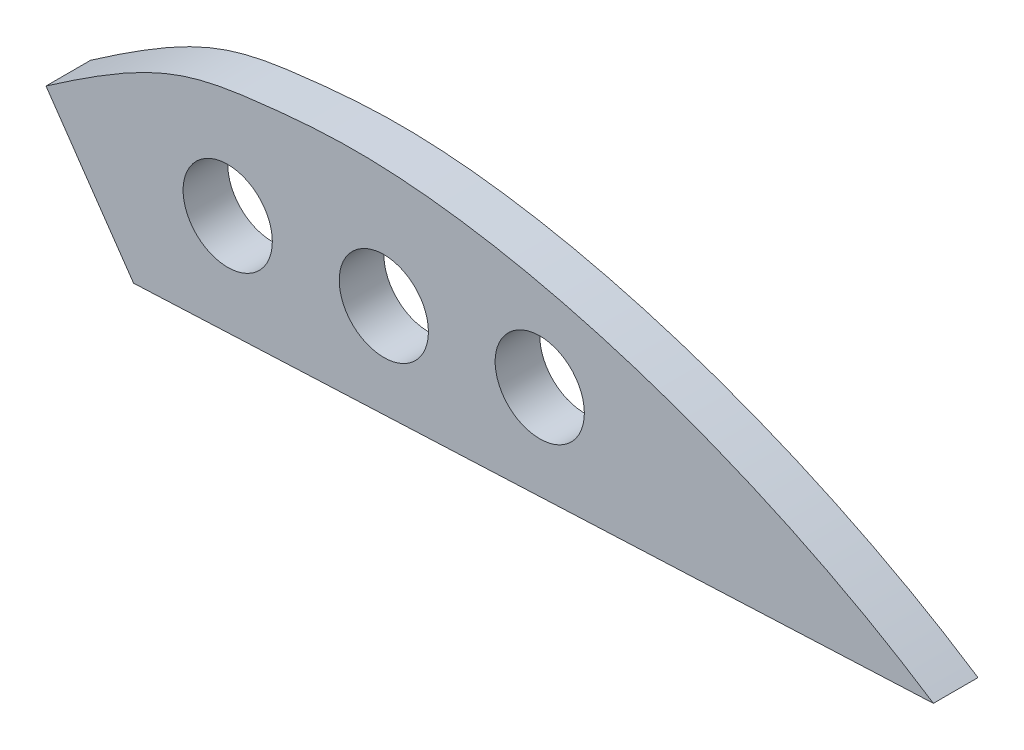
ISO-10303-21;
HEADER;
FILE_DESCRIPTION(('STEP AP214'),'2;1');
FILE_NAME('part.step','',(''),(''),'','','');
FILE_SCHEMA(('AUTOMOTIVE_DESIGN { 1 0 10303 214 1 1 1 1 }'));
ENDSEC;
DATA;
#1=APPLICATION_CONTEXT('core data for automotive mechanical design processes');
#2=APPLICATION_PROTOCOL_DEFINITION('international standard','automotive_design',2000,#1);
#3=PRODUCT_CONTEXT('',#1,'mechanical');
#4=PRODUCT('Part','Part','',(#3));
#5=PRODUCT_RELATED_PRODUCT_CATEGORY('part','',(#4));
#6=PRODUCT_DEFINITION_FORMATION('','',#4);
#7=PRODUCT_DEFINITION_CONTEXT('part definition',#1,'design');
#8=PRODUCT_DEFINITION('design','',#6,#7);
#9=PRODUCT_DEFINITION_SHAPE('','',#8);
#10=(LENGTH_UNIT() NAMED_UNIT(*) SI_UNIT(.MILLI.,.METRE.));
#11=(NAMED_UNIT(*) PLANE_ANGLE_UNIT() SI_UNIT($,.RADIAN.));
#12=(NAMED_UNIT(*) SI_UNIT($,.STERADIAN.) SOLID_ANGLE_UNIT());
#13=UNCERTAINTY_MEASURE_WITH_UNIT(LENGTH_MEASURE(1.E-05),#10,'distance_accuracy_value','');
#14=(GEOMETRIC_REPRESENTATION_CONTEXT(3) GLOBAL_UNCERTAINTY_ASSIGNED_CONTEXT((#13)) GLOBAL_UNIT_ASSIGNED_CONTEXT((#10,
#11,#12)) REPRESENTATION_CONTEXT('',''));
#15=CARTESIAN_POINT('',(0.,0.,0.));
#16=DIRECTION('',(0.,0.,1.));
#17=DIRECTION('',(1.,0.,0.));
#18=AXIS2_PLACEMENT_3D('',#15,#16,#17);
#19=CARTESIAN_POINT('',(-1659.53553734202,615.24308702669,10.));
#20=DIRECTION('',(0.,0.,1.));
#21=DIRECTION('',(1.,0.,0.));
#22=AXIS2_PLACEMENT_3D('',#19,#20,#21);
#23=PLANE('',#22);
#24=CARTESIAN_POINT('',(-1702.86573801061,588.986400452499,10.));
#25=DIRECTION('',(0.,0.,1.));
#26=DIRECTION('',(1.,0.,0.));
#27=AXIS2_PLACEMENT_3D('',#24,#25,#26);
#28=CIRCLE('',#27,10.0000000000001);
#29=CARTESIAN_POINT('',(-1692.86573801061,588.986400452499,10.));
#30=VERTEX_POINT('',#29);
#31=EDGE_CURVE('E121',#30,#30,#28,.T.);
#32=ORIENTED_EDGE('',*,*,#31,.F.);
#33=EDGE_LOOP('',(#32));
#34=FACE_BOUND('',#33,.T.);
#35=CARTESIAN_POINT('',(-1544.64995665935,573.441433080312,10.));
#36=CARTESIAN_POINT('',(-1585.71664888804,600.423930322912,10.));
#37=CARTESIAN_POINT('',(-1646.28028973819,619.241808081414,10.));
#38=CARTESIAN_POINT('',(-1709.38954114273,613.399774738818,10.));
#39=CARTESIAN_POINT('',(-1719.50790421298,610.537812827554,10.));
#40=CARTESIAN_POINT('',(-1743.60796018332,593.83047017767,10.));
#41=B_SPLINE_CURVE_WITH_KNOTS('',3,(#35,#36,#37,#38,#39,#40),.UNSPECIFIED.,.F.,.F.,(4,1,1,4),
(0.,0.579445357910707,0.679445357910707,1.),.UNSPECIFIED.);
#42=CARTESIAN_POINT('',(-1544.64995665935,573.441433080312,10.));
#43=VERTEX_POINT('',#42);
#44=CARTESIAN_POINT('',(-1743.60796018332,593.83047017767,10.));
#45=VERTEX_POINT('',#44);
#46=EDGE_CURVE('E77',#43,#45,#41,.T.);
#47=ORIENTED_EDGE('',*,*,#46,.T.);
#48=DIRECTION('',(0.567607096396232,-0.823299571310856,0.));
#49=VECTOR('',#48,1.);
#50=CARTESIAN_POINT('',(-1743.60796018332,593.83047017767,10.));
#51=LINE('',#50,#49);
#52=CARTESIAN_POINT('',(-1723.97557604015,565.354199265099,10.));
#53=VERTEX_POINT('',#52);
#54=EDGE_CURVE('E73',#45,#53,#51,.T.);
#55=ORIENTED_EDGE('',*,*,#54,.T.);
#56=DIRECTION('',(0.998984631984055,0.0450522481090856,0.));
#57=VECTOR('',#56,1.);
#58=CARTESIAN_POINT('',(-1723.97557604015,565.354199265099,10.));
#59=LINE('',#58,#57);
#60=EDGE_CURVE('E53',#53,#43,#59,.T.);
#61=ORIENTED_EDGE('',*,*,#60,.T.);
#62=EDGE_LOOP('',(#47,#55,#61));
#63=FACE_BOUND('',#62,.T.);
#64=CARTESIAN_POINT('',(-1667.86573801061,588.986400452499,10.));
#65=DIRECTION('',(0.,0.,1.));
#66=DIRECTION('',(1.,0.,0.));
#67=AXIS2_PLACEMENT_3D('',#64,#65,#66);
#68=CIRCLE('',#67,9.99999999999985);
#69=CARTESIAN_POINT('',(-1657.86573801061,588.986400452499,10.));
#70=VERTEX_POINT('',#69);
#71=EDGE_CURVE('E86',#70,#70,#68,.T.);
#72=ORIENTED_EDGE('',*,*,#71,.F.);
#73=EDGE_LOOP('',(#72));
#74=FACE_BOUND('',#73,.T.);
#75=CARTESIAN_POINT('',(-1632.90629090363,590.67075729533,10.));
#76=DIRECTION('',(0.,0.,1.));
#77=DIRECTION('',(1.,0.,0.));
#78=AXIS2_PLACEMENT_3D('',#75,#76,#77);
#79=CIRCLE('',#78,10.0000000000001);
#80=CARTESIAN_POINT('',(-1622.90629090363,590.67075729533,10.));
#81=VERTEX_POINT('',#80);
#82=EDGE_CURVE('E116',#81,#81,#79,.T.);
#83=ORIENTED_EDGE('',*,*,#82,.F.);
#84=EDGE_LOOP('',(#83));
#85=FACE_BOUND('',#84,.T.);
#86=ADVANCED_FACE('F35',(#34,#63,#74,#85),#23,.T.);
#87=CARTESIAN_POINT('',(-1659.53553734202,615.24308702669,0.));
#88=DIRECTION('',(0.,0.,1.));
#89=DIRECTION('',(1.,0.,0.));
#90=AXIS2_PLACEMENT_3D('',#87,#88,#89);
#91=PLANE('',#90);
#92=CARTESIAN_POINT('',(-1544.64995665935,573.441433080312,0.));
#93=CARTESIAN_POINT('',(-1585.71664888804,600.423930322912,0.));
#94=CARTESIAN_POINT('',(-1646.28028973819,619.241808081414,0.));
#95=CARTESIAN_POINT('',(-1709.38954114273,613.399774738818,0.));
#96=CARTESIAN_POINT('',(-1719.50790421298,610.537812827554,0.));
#97=CARTESIAN_POINT('',(-1743.60796018332,593.83047017767,0.));
#98=B_SPLINE_CURVE_WITH_KNOTS('',3,(#92,#93,#94,#95,#96,#97),.UNSPECIFIED.,.F.,.F.,(4,1,1,4),
(0.,0.579445357910707,0.679445357910707,1.),.UNSPECIFIED.);
#99=CARTESIAN_POINT('',(-1544.64995665935,573.441433080312,0.));
#100=VERTEX_POINT('',#99);
#101=CARTESIAN_POINT('',(-1743.60796018332,593.83047017767,0.));
#102=VERTEX_POINT('',#101);
#103=EDGE_CURVE('E83',#100,#102,#98,.T.);
#104=ORIENTED_EDGE('',*,*,#103,.F.);
#105=DIRECTION('',(0.998984631984055,0.0450522481090856,0.));
#106=VECTOR('',#105,1.);
#107=CARTESIAN_POINT('',(-1723.97557604015,565.354199265099,0.));
#108=LINE('',#107,#106);
#109=CARTESIAN_POINT('',(-1723.97557604015,565.354199265099,0.));
#110=VERTEX_POINT('',#109);
#111=EDGE_CURVE('E70',#110,#100,#108,.T.);
#112=ORIENTED_EDGE('',*,*,#111,.F.);
#113=DIRECTION('',(0.567607096396232,-0.823299571310856,0.));
#114=VECTOR('',#113,1.);
#115=CARTESIAN_POINT('',(-1743.60796018332,593.83047017767,0.));
#116=LINE('',#115,#114);
#117=EDGE_CURVE('E65',#102,#110,#116,.T.);
#118=ORIENTED_EDGE('',*,*,#117,.F.);
#119=EDGE_LOOP('',(#104,#112,#118));
#120=FACE_BOUND('',#119,.T.);
#121=CARTESIAN_POINT('',(-1667.86573801061,588.986400452499,0.));
#122=DIRECTION('',(0.,0.,1.));
#123=DIRECTION('',(1.,0.,0.));
#124=AXIS2_PLACEMENT_3D('',#121,#122,#123);
#125=CIRCLE('',#124,9.99999999999985);
#126=CARTESIAN_POINT('',(-1657.86573801061,588.986400452499,0.));
#127=VERTEX_POINT('',#126);
#128=EDGE_CURVE('E90',#127,#127,#125,.T.);
#129=ORIENTED_EDGE('',*,*,#128,.T.);
#130=EDGE_LOOP('',(#129));
#131=FACE_BOUND('',#130,.T.);
#132=CARTESIAN_POINT('',(-1702.86573801061,588.986400452499,0.));
#133=DIRECTION('',(0.,0.,1.));
#134=DIRECTION('',(1.,0.,0.));
#135=AXIS2_PLACEMENT_3D('',#132,#133,#134);
#136=CIRCLE('',#135,10.0000000000001);
#137=CARTESIAN_POINT('',(-1692.86573801061,588.986400452499,0.));
#138=VERTEX_POINT('',#137);
#139=EDGE_CURVE('E111',#138,#138,#136,.T.);
#140=ORIENTED_EDGE('',*,*,#139,.T.);
#141=EDGE_LOOP('',(#140));
#142=FACE_BOUND('',#141,.T.);
#143=CARTESIAN_POINT('',(-1632.90629090363,590.67075729533,0.));
#144=DIRECTION('',(0.,0.,1.));
#145=DIRECTION('',(1.,0.,0.));
#146=AXIS2_PLACEMENT_3D('',#143,#144,#145);
#147=CIRCLE('',#146,10.0000000000001);
#148=CARTESIAN_POINT('',(-1622.90629090363,590.67075729533,0.));
#149=VERTEX_POINT('',#148);
#150=EDGE_CURVE('E114',#149,#149,#147,.T.);
#151=ORIENTED_EDGE('',*,*,#150,.T.);
#152=EDGE_LOOP('',(#151));
#153=FACE_BOUND('',#152,.T.);
#154=ADVANCED_FACE('F101',(#120,#131,#142,#153),#91,.F.);
#155=DIRECTION('',(0.,0.,-1.));
#156=VECTOR('',#155,1.);
#157=SURFACE_OF_LINEAR_EXTRUSION('',#41,#156);
#158=ORIENTED_EDGE('',*,*,#103,.T.);
#159=DIRECTION('',(0.,0.,-1.));
#160=VECTOR('',#159,1.);
#161=CARTESIAN_POINT('',(-1743.60796018332,593.83047017767,10.));
#162=LINE('',#161,#160);
#163=EDGE_CURVE('E11',#45,#102,#162,.T.);
#164=ORIENTED_EDGE('',*,*,#163,.F.);
#165=ORIENTED_EDGE('',*,*,#46,.F.);
#166=DIRECTION('',(0.,0.,-1.));
#167=VECTOR('',#166,1.);
#168=CARTESIAN_POINT('',(-1544.64995665935,573.441433080312,10.));
#169=LINE('',#168,#167);
#170=EDGE_CURVE('E84',#43,#100,#169,.T.);
#171=ORIENTED_EDGE('',*,*,#170,.T.);
#172=EDGE_LOOP('',(#158,#164,#165,#171));
#173=FACE_BOUND('',#172,.T.);
#174=ADVANCED_FACE('F37',(#173),#157,.F.);
#175=CARTESIAN_POINT('',(-1743.60796018332,593.83047017767,10.));
#176=DIRECTION('',(0.823299571310856,0.567607096396232,0.));
#177=DIRECTION('',(-0.567607096396232,0.823299571310856,0.));
#178=AXIS2_PLACEMENT_3D('',#175,#176,#177);
#179=PLANE('',#178);
#180=ORIENTED_EDGE('',*,*,#117,.T.);
#181=DIRECTION('',(0.,0.,-1.));
#182=VECTOR('',#181,1.);
#183=CARTESIAN_POINT('',(-1723.97557604015,565.354199265099,10.));
#184=LINE('',#183,#182);
#185=EDGE_CURVE('E45',#53,#110,#184,.T.);
#186=ORIENTED_EDGE('',*,*,#185,.F.);
#187=ORIENTED_EDGE('',*,*,#54,.F.);
#188=ORIENTED_EDGE('',*,*,#163,.T.);
#189=EDGE_LOOP('',(#180,#186,#187,#188));
#190=FACE_BOUND('',#189,.T.);
#191=ADVANCED_FACE('F74',(#190),#179,.F.);
#192=CARTESIAN_POINT('',(-1723.97557604015,565.354199265099,10.));
#193=DIRECTION('',(-0.0450522481090856,0.998984631984055,0.));
#194=DIRECTION('',(-0.998984631984055,-0.0450522481090856,0.));
#195=AXIS2_PLACEMENT_3D('',#192,#193,#194);
#196=PLANE('',#195);
#197=ORIENTED_EDGE('',*,*,#111,.T.);
#198=ORIENTED_EDGE('',*,*,#170,.F.);
#199=ORIENTED_EDGE('',*,*,#60,.F.);
#200=ORIENTED_EDGE('',*,*,#185,.T.);
#201=EDGE_LOOP('',(#197,#198,#199,#200));
#202=FACE_BOUND('',#201,.T.);
#203=ADVANCED_FACE('F100',(#202),#196,.F.);
#204=CARTESIAN_POINT('',(-1667.86573801061,588.986400452499,10.));
#205=DIRECTION('',(0.,0.,-1.));
#206=DIRECTION('',(-1.,0.,0.));
#207=AXIS2_PLACEMENT_3D('',#204,#205,#206);
#208=CYLINDRICAL_SURFACE('',#207,9.99999999999985);
#209=ORIENTED_EDGE('',*,*,#71,.T.);
#210=EDGE_LOOP('',(#209));
#211=FACE_BOUND('',#210,.T.);
#212=ORIENTED_EDGE('',*,*,#128,.F.);
#213=EDGE_LOOP('',(#212));
#214=FACE_BOUND('',#213,.T.);
#215=ADVANCED_FACE('F141',(#211,#214),#208,.F.);
#216=CARTESIAN_POINT('',(-1702.86573801061,588.986400452499,10.));
#217=DIRECTION('',(0.,0.,-1.));
#218=DIRECTION('',(-1.,0.,0.));
#219=AXIS2_PLACEMENT_3D('',#216,#217,#218);
#220=CYLINDRICAL_SURFACE('',#219,10.0000000000001);
#221=ORIENTED_EDGE('',*,*,#31,.T.);
#222=EDGE_LOOP('',(#221));
#223=FACE_BOUND('',#222,.T.);
#224=ORIENTED_EDGE('',*,*,#139,.F.);
#225=EDGE_LOOP('',(#224));
#226=FACE_BOUND('',#225,.T.);
#227=ADVANCED_FACE('F133',(#223,#226),#220,.F.);
#228=CARTESIAN_POINT('',(-1632.90629090363,590.67075729533,10.));
#229=DIRECTION('',(0.,0.,-1.));
#230=DIRECTION('',(-1.,0.,0.));
#231=AXIS2_PLACEMENT_3D('',#228,#229,#230);
#232=CYLINDRICAL_SURFACE('',#231,10.0000000000001);
#233=ORIENTED_EDGE('',*,*,#82,.T.);
#234=EDGE_LOOP('',(#233));
#235=FACE_BOUND('',#234,.T.);
#236=ORIENTED_EDGE('',*,*,#150,.F.);
#237=EDGE_LOOP('',(#236));
#238=FACE_BOUND('',#237,.T.);
#239=ADVANCED_FACE('F187',(#235,#238),#232,.F.);
#240=CLOSED_SHELL('',(#86,#154,#174,#191,#203,#215,#227,#239));
#241=MANIFOLD_SOLID_BREP('B2',#240);
#242=ADVANCED_BREP_SHAPE_REPRESENTATION('',(#18,#241),#14);
#243=SHAPE_DEFINITION_REPRESENTATION(#9,#242);
ENDSEC;
END-ISO-10303-21;
